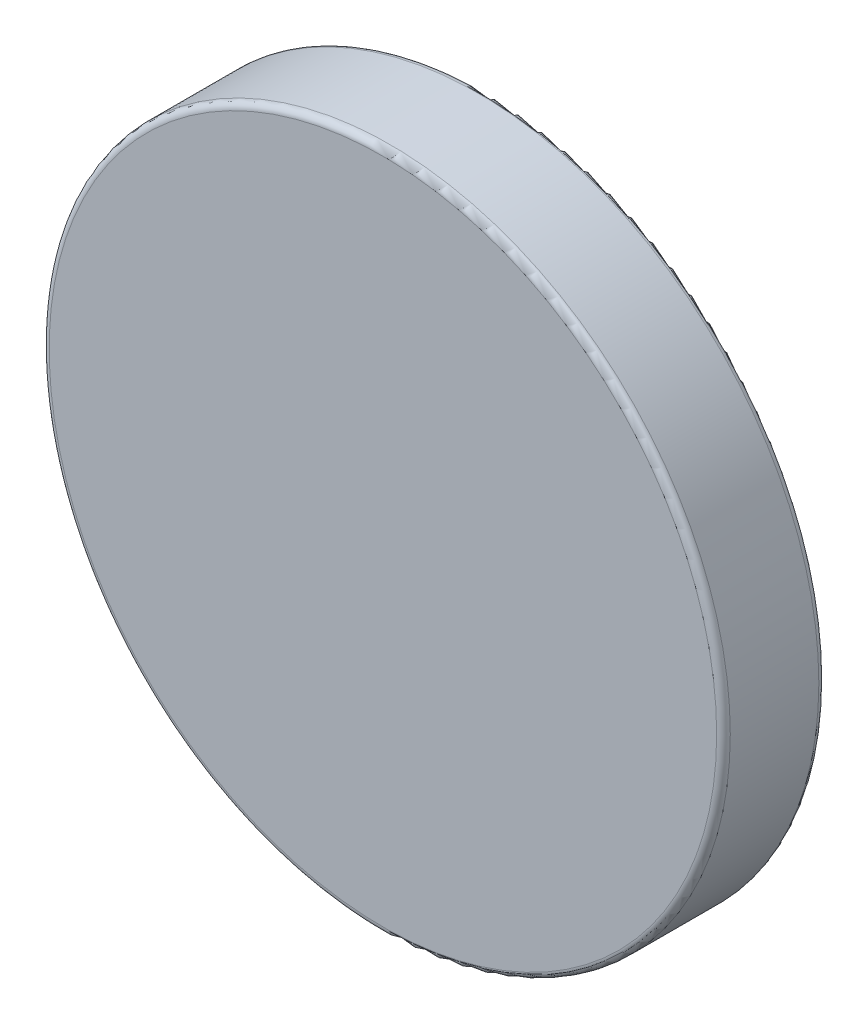
ISO-10303-21;
HEADER;
FILE_DESCRIPTION(('STEP AP214'),'2;1');
FILE_NAME('part.step','',(''),(''),'','','');
FILE_SCHEMA(('AUTOMOTIVE_DESIGN { 1 0 10303 214 1 1 1 1 }'));
ENDSEC;
DATA;
#1=APPLICATION_CONTEXT('core data for automotive mechanical design processes');
#2=APPLICATION_PROTOCOL_DEFINITION('international standard','automotive_design',2000,#1);
#3=PRODUCT_CONTEXT('',#1,'mechanical');
#4=PRODUCT('Part','Part','',(#3));
#5=PRODUCT_RELATED_PRODUCT_CATEGORY('part','',(#4));
#6=PRODUCT_DEFINITION_FORMATION('','',#4);
#7=PRODUCT_DEFINITION_CONTEXT('part definition',#1,'design');
#8=PRODUCT_DEFINITION('design','',#6,#7);
#9=PRODUCT_DEFINITION_SHAPE('','',#8);
#10=(LENGTH_UNIT() NAMED_UNIT(*) SI_UNIT(.MILLI.,.METRE.));
#11=(NAMED_UNIT(*) PLANE_ANGLE_UNIT() SI_UNIT($,.RADIAN.));
#12=(NAMED_UNIT(*) SI_UNIT($,.STERADIAN.) SOLID_ANGLE_UNIT());
#13=UNCERTAINTY_MEASURE_WITH_UNIT(LENGTH_MEASURE(1.E-05),#10,'distance_accuracy_value','');
#14=(GEOMETRIC_REPRESENTATION_CONTEXT(3) GLOBAL_UNCERTAINTY_ASSIGNED_CONTEXT((#13)) GLOBAL_UNIT_ASSIGNED_CONTEXT((#10,
#11,#12)) REPRESENTATION_CONTEXT('',''));
#15=CARTESIAN_POINT('',(0.,0.,0.));
#16=DIRECTION('',(0.,0.,1.));
#17=DIRECTION('',(1.,0.,0.));
#18=AXIS2_PLACEMENT_3D('',#15,#16,#17);
#19=CARTESIAN_POINT('',(0.,0.,3.));
#20=DIRECTION('',(0.,0.,-1.));
#21=DIRECTION('',(-1.,0.,0.));
#22=AXIS2_PLACEMENT_3D('',#19,#20,#21);
#23=CYLINDRICAL_SURFACE('',#22,10.);
#24=CARTESIAN_POINT('',(0.,0.,0.2));
#25=DIRECTION('',(0.,0.,1.));
#26=DIRECTION('',(1.,0.,0.));
#27=AXIS2_PLACEMENT_3D('',#24,#25,#26);
#28=CIRCLE('',#27,10.);
#29=CARTESIAN_POINT('',(10.,0.,0.2));
#30=VERTEX_POINT('',#29);
#31=EDGE_CURVE('E44',#30,#30,#28,.T.);
#32=ORIENTED_EDGE('',*,*,#31,.T.);
#33=EDGE_LOOP('',(#32));
#34=FACE_BOUND('',#33,.T.);
#35=CARTESIAN_POINT('',(0.,0.,2.8));
#36=DIRECTION('',(0.,0.,1.));
#37=DIRECTION('',(1.,0.,0.));
#38=AXIS2_PLACEMENT_3D('',#35,#36,#37);
#39=CIRCLE('',#38,10.);
#40=CARTESIAN_POINT('',(10.,0.,2.8));
#41=VERTEX_POINT('',#40);
#42=EDGE_CURVE('E48',#41,#41,#39,.F.);
#43=ORIENTED_EDGE('',*,*,#42,.T.);
#44=EDGE_LOOP('',(#43));
#45=FACE_BOUND('',#44,.T.);
#46=ADVANCED_FACE('F33',(#34,#45),#23,.T.);
#47=CARTESIAN_POINT('',(0.,0.,3.));
#48=DIRECTION('',(0.,0.,1.));
#49=DIRECTION('',(1.,0.,0.));
#50=AXIS2_PLACEMENT_3D('',#47,#48,#49);
#51=PLANE('',#50);
#52=CARTESIAN_POINT('',(0.,0.,3.));
#53=DIRECTION('',(0.,0.,1.));
#54=DIRECTION('',(1.,0.,0.));
#55=AXIS2_PLACEMENT_3D('',#52,#53,#54);
#56=CIRCLE('',#55,9.8);
#57=CARTESIAN_POINT('',(9.8,0.,3.));
#58=VERTEX_POINT('',#57);
#59=EDGE_CURVE('E10',#58,#58,#56,.T.);
#60=ORIENTED_EDGE('',*,*,#59,.T.);
#61=EDGE_LOOP('',(#60));
#62=FACE_BOUND('',#61,.T.);
#63=ADVANCED_FACE('F64',(#62),#51,.T.);
#64=CARTESIAN_POINT('',(0.,0.,0.));
#65=DIRECTION('',(0.,0.,1.));
#66=DIRECTION('',(1.,0.,0.));
#67=AXIS2_PLACEMENT_3D('',#64,#65,#66);
#68=PLANE('',#67);
#69=CARTESIAN_POINT('',(0.,0.,0.));
#70=DIRECTION('',(0.,0.,1.));
#71=DIRECTION('',(1.,0.,0.));
#72=AXIS2_PLACEMENT_3D('',#69,#70,#71);
#73=CIRCLE('',#72,9.8);
#74=CARTESIAN_POINT('',(9.8,0.,0.));
#75=VERTEX_POINT('',#74);
#76=EDGE_CURVE('E40',#75,#75,#73,.F.);
#77=ORIENTED_EDGE('',*,*,#76,.T.);
#78=EDGE_LOOP('',(#77));
#79=FACE_BOUND('',#78,.T.);
#80=ADVANCED_FACE('F61',(#79),#68,.F.);
#81=CARTESIAN_POINT('',(0.,0.,0.2));
#82=DIRECTION('',(0.,0.,1.));
#83=DIRECTION('',(1.,0.,0.));
#84=AXIS2_PLACEMENT_3D('',#81,#82,#83);
#85=TOROIDAL_SURFACE('',#84,9.8,0.2);
#86=ORIENTED_EDGE('',*,*,#76,.F.);
#87=EDGE_LOOP('',(#86));
#88=FACE_BOUND('',#87,.T.);
#89=ORIENTED_EDGE('',*,*,#31,.F.);
#90=EDGE_LOOP('',(#89));
#91=FACE_BOUND('',#90,.T.);
#92=ADVANCED_FACE('F57',(#88,#91),#85,.T.);
#93=CARTESIAN_POINT('',(0.,0.,2.8));
#94=DIRECTION('',(0.,0.,1.));
#95=DIRECTION('',(1.,0.,0.));
#96=AXIS2_PLACEMENT_3D('',#93,#94,#95);
#97=TOROIDAL_SURFACE('',#96,9.8,0.2);
#98=ORIENTED_EDGE('',*,*,#42,.F.);
#99=EDGE_LOOP('',(#98));
#100=FACE_BOUND('',#99,.T.);
#101=ORIENTED_EDGE('',*,*,#59,.F.);
#102=EDGE_LOOP('',(#101));
#103=FACE_BOUND('',#102,.T.);
#104=ADVANCED_FACE('F35',(#100,#103),#97,.T.);
#105=CLOSED_SHELL('',(#46,#63,#80,#92,#104));
#106=MANIFOLD_SOLID_BREP('B2',#105);
#107=ADVANCED_BREP_SHAPE_REPRESENTATION('',(#18,#106),#14);
#108=SHAPE_DEFINITION_REPRESENTATION(#9,#107);
ENDSEC;
END-ISO-10303-21;
